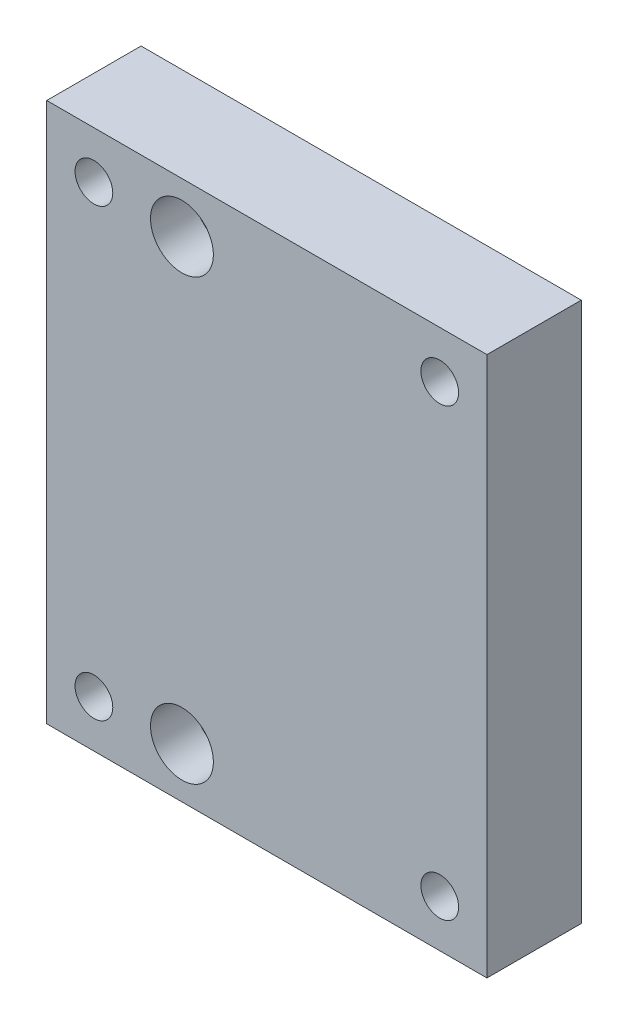
ISO-10303-21;
HEADER;
FILE_DESCRIPTION(('STEP AP214'),'2;1');
FILE_NAME('part.step','',(''),(''),'','','');
FILE_SCHEMA(('AUTOMOTIVE_DESIGN { 1 0 10303 214 1 1 1 1 }'));
ENDSEC;
DATA;
#1=APPLICATION_CONTEXT('core data for automotive mechanical design processes');
#2=APPLICATION_PROTOCOL_DEFINITION('international standard','automotive_design',2000,#1);
#3=PRODUCT_CONTEXT('',#1,'mechanical');
#4=PRODUCT('Part','Part','',(#3));
#5=PRODUCT_RELATED_PRODUCT_CATEGORY('part','',(#4));
#6=PRODUCT_DEFINITION_FORMATION('','',#4);
#7=PRODUCT_DEFINITION_CONTEXT('part definition',#1,'design');
#8=PRODUCT_DEFINITION('design','',#6,#7);
#9=PRODUCT_DEFINITION_SHAPE('','',#8);
#10=(LENGTH_UNIT() NAMED_UNIT(*) SI_UNIT(.MILLI.,.METRE.));
#11=(NAMED_UNIT(*) PLANE_ANGLE_UNIT() SI_UNIT($,.RADIAN.));
#12=(NAMED_UNIT(*) SI_UNIT($,.STERADIAN.) SOLID_ANGLE_UNIT());
#13=UNCERTAINTY_MEASURE_WITH_UNIT(LENGTH_MEASURE(1.E-05),#10,'distance_accuracy_value','');
#14=(GEOMETRIC_REPRESENTATION_CONTEXT(3) GLOBAL_UNCERTAINTY_ASSIGNED_CONTEXT((#13)) GLOBAL_UNIT_ASSIGNED_CONTEXT((#10,
#11,#12)) REPRESENTATION_CONTEXT('',''));
#15=CARTESIAN_POINT('',(0.,0.,0.));
#16=DIRECTION('',(0.,0.,1.));
#17=DIRECTION('',(1.,0.,0.));
#18=AXIS2_PLACEMENT_3D('',#15,#16,#17);
#19=CARTESIAN_POINT('',(-27.5,-35.425,0.));
#20=DIRECTION('',(0.,0.,1.));
#21=DIRECTION('',(1.,0.,0.));
#22=AXIS2_PLACEMENT_3D('',#19,#20,#21);
#23=CYLINDRICAL_SURFACE('',#22,3.);
#24=CARTESIAN_POINT('',(-27.5,-35.425,0.));
#25=DIRECTION('',(0.,0.,1.));
#26=DIRECTION('',(1.,0.,0.));
#27=AXIS2_PLACEMENT_3D('',#24,#25,#26);
#28=CIRCLE('',#27,3.);
#29=CARTESIAN_POINT('',(-24.5,-35.425,0.));
#30=VERTEX_POINT('',#29);
#31=EDGE_CURVE('E41',#30,#30,#28,.T.);
#32=ORIENTED_EDGE('',*,*,#31,.F.);
#33=EDGE_LOOP('',(#32));
#34=FACE_BOUND('',#33,.T.);
#35=CARTESIAN_POINT('',(-27.5,-35.425,15.));
#36=DIRECTION('',(0.,0.,1.));
#37=DIRECTION('',(1.,0.,0.));
#38=AXIS2_PLACEMENT_3D('',#35,#36,#37);
#39=CIRCLE('',#38,3.);
#40=CARTESIAN_POINT('',(-24.5,-35.425,15.));
#41=VERTEX_POINT('',#40);
#42=EDGE_CURVE('E11',#41,#41,#39,.T.);
#43=ORIENTED_EDGE('',*,*,#42,.T.);
#44=EDGE_LOOP('',(#43));
#45=FACE_BOUND('',#44,.T.);
#46=ADVANCED_FACE('F33',(#34,#45),#23,.F.);
#47=CARTESIAN_POINT('',(27.5,-35.425,0.));
#48=DIRECTION('',(0.,0.,1.));
#49=DIRECTION('',(1.,0.,0.));
#50=AXIS2_PLACEMENT_3D('',#47,#48,#49);
#51=CYLINDRICAL_SURFACE('',#50,3.);
#52=CARTESIAN_POINT('',(27.5,-35.425,0.));
#53=DIRECTION('',(0.,0.,1.));
#54=DIRECTION('',(1.,0.,0.));
#55=AXIS2_PLACEMENT_3D('',#52,#53,#54);
#56=CIRCLE('',#55,3.);
#57=CARTESIAN_POINT('',(30.5,-35.425,0.));
#58=VERTEX_POINT('',#57);
#59=EDGE_CURVE('E111',#58,#58,#56,.T.);
#60=ORIENTED_EDGE('',*,*,#59,.F.);
#61=EDGE_LOOP('',(#60));
#62=FACE_BOUND('',#61,.T.);
#63=CARTESIAN_POINT('',(27.5,-35.425,15.));
#64=DIRECTION('',(0.,0.,1.));
#65=DIRECTION('',(1.,0.,0.));
#66=AXIS2_PLACEMENT_3D('',#63,#64,#65);
#67=CIRCLE('',#66,3.);
#68=CARTESIAN_POINT('',(30.5,-35.425,15.));
#69=VERTEX_POINT('',#68);
#70=EDGE_CURVE('E122',#69,#69,#67,.T.);
#71=ORIENTED_EDGE('',*,*,#70,.T.);
#72=EDGE_LOOP('',(#71));
#73=FACE_BOUND('',#72,.T.);
#74=ADVANCED_FACE('F131',(#62,#73),#51,.F.);
#75=CARTESIAN_POINT('',(-13.5,-34.925,0.));
#76=DIRECTION('',(0.,0.,1.));
#77=DIRECTION('',(1.,0.,0.));
#78=AXIS2_PLACEMENT_3D('',#75,#76,#77);
#79=CYLINDRICAL_SURFACE('',#78,3.);
#80=CARTESIAN_POINT('',(-13.5,-34.925,0.));
#81=DIRECTION('',(0.,0.,1.));
#82=DIRECTION('',(1.,0.,0.));
#83=AXIS2_PLACEMENT_3D('',#80,#81,#82);
#84=CIRCLE('',#83,3.);
#85=CARTESIAN_POINT('',(-10.5,-34.925,0.));
#86=VERTEX_POINT('',#85);
#87=EDGE_CURVE('E119',#86,#86,#84,.T.);
#88=ORIENTED_EDGE('',*,*,#87,.F.);
#89=EDGE_LOOP('',(#88));
#90=FACE_BOUND('',#89,.T.);
#91=CARTESIAN_POINT('',(-13.5,-34.925,8.));
#92=DIRECTION('',(0.,0.,1.));
#93=DIRECTION('',(1.,0.,0.));
#94=AXIS2_PLACEMENT_3D('',#91,#92,#93);
#95=CIRCLE('',#94,3.);
#96=CARTESIAN_POINT('',(-10.5,-34.925,8.));
#97=VERTEX_POINT('',#96);
#98=EDGE_CURVE('E115',#97,#97,#95,.F.);
#99=ORIENTED_EDGE('',*,*,#98,.F.);
#100=EDGE_LOOP('',(#99));
#101=FACE_BOUND('',#100,.T.);
#102=ADVANCED_FACE('F149',(#90,#101),#79,.F.);
#103=CARTESIAN_POINT('',(-13.5,34.925,0.));
#104=DIRECTION('',(0.,0.,1.));
#105=DIRECTION('',(1.,0.,0.));
#106=AXIS2_PLACEMENT_3D('',#103,#104,#105);
#107=CYLINDRICAL_SURFACE('',#106,3.);
#108=CARTESIAN_POINT('',(-13.5,34.925,0.));
#109=DIRECTION('',(0.,0.,1.));
#110=DIRECTION('',(1.,0.,0.));
#111=AXIS2_PLACEMENT_3D('',#108,#109,#110);
#112=CIRCLE('',#111,3.);
#113=CARTESIAN_POINT('',(-10.5,34.925,0.));
#114=VERTEX_POINT('',#113);
#115=EDGE_CURVE('E104',#114,#114,#112,.T.);
#116=ORIENTED_EDGE('',*,*,#115,.F.);
#117=EDGE_LOOP('',(#116));
#118=FACE_BOUND('',#117,.T.);
#119=CARTESIAN_POINT('',(-13.5,34.925,8.));
#120=DIRECTION('',(0.,0.,1.));
#121=DIRECTION('',(1.,0.,0.));
#122=AXIS2_PLACEMENT_3D('',#119,#120,#121);
#123=CIRCLE('',#122,3.);
#124=CARTESIAN_POINT('',(-10.5,34.925,8.));
#125=VERTEX_POINT('',#124);
#126=EDGE_CURVE('E112',#125,#125,#123,.F.);
#127=ORIENTED_EDGE('',*,*,#126,.F.);
#128=EDGE_LOOP('',(#127));
#129=FACE_BOUND('',#128,.T.);
#130=ADVANCED_FACE('F158',(#118,#129),#107,.F.);
#131=CARTESIAN_POINT('',(-35.,-42.925,15.));
#132=DIRECTION('',(1.,0.,0.));
#133=DIRECTION('',(0.,0.,-1.));
#134=AXIS2_PLACEMENT_3D('',#131,#132,#133);
#135=PLANE('',#134);
#136=DIRECTION('',(0.,-1.,0.));
#137=VECTOR('',#136,1.);
#138=CARTESIAN_POINT('',(-35.,-42.925,0.));
#139=LINE('',#138,#137);
#140=CARTESIAN_POINT('',(-35.,42.925,0.));
#141=VERTEX_POINT('',#140);
#142=CARTESIAN_POINT('',(-35.,-42.925,0.));
#143=VERTEX_POINT('',#142);
#144=EDGE_CURVE('E101',#141,#143,#139,.T.);
#145=ORIENTED_EDGE('',*,*,#144,.T.);
#146=DIRECTION('',(0.,0.,-1.));
#147=VECTOR('',#146,1.);
#148=CARTESIAN_POINT('',(-35.,-42.925,15.));
#149=LINE('',#148,#147);
#150=CARTESIAN_POINT('',(-35.,-42.925,15.));
#151=VERTEX_POINT('',#150);
#152=EDGE_CURVE('E92',#151,#143,#149,.T.);
#153=ORIENTED_EDGE('',*,*,#152,.F.);
#154=DIRECTION('',(0.,-1.,0.));
#155=VECTOR('',#154,1.);
#156=CARTESIAN_POINT('',(-35.,-42.925,15.));
#157=LINE('',#156,#155);
#158=CARTESIAN_POINT('',(-35.,42.925,15.));
#159=VERTEX_POINT('',#158);
#160=EDGE_CURVE('E86',#159,#151,#157,.T.);
#161=ORIENTED_EDGE('',*,*,#160,.F.);
#162=DIRECTION('',(0.,0.,-1.));
#163=VECTOR('',#162,1.);
#164=CARTESIAN_POINT('',(-35.,42.925,15.));
#165=LINE('',#164,#163);
#166=EDGE_CURVE('E97',#159,#141,#165,.T.);
#167=ORIENTED_EDGE('',*,*,#166,.T.);
#168=EDGE_LOOP('',(#145,#153,#161,#167));
#169=FACE_BOUND('',#168,.T.);
#170=ADVANCED_FACE('F156',(#169),#135,.F.);
#171=CARTESIAN_POINT('',(35.,-42.925,15.));
#172=DIRECTION('',(0.,1.,0.));
#173=DIRECTION('',(-1.,0.,0.));
#174=AXIS2_PLACEMENT_3D('',#171,#172,#173);
#175=PLANE('',#174);
#176=DIRECTION('',(1.,0.,0.));
#177=VECTOR('',#176,1.);
#178=CARTESIAN_POINT('',(35.,-42.925,0.));
#179=LINE('',#178,#177);
#180=CARTESIAN_POINT('',(35.,-42.925,0.));
#181=VERTEX_POINT('',#180);
#182=EDGE_CURVE('E91',#143,#181,#179,.T.);
#183=ORIENTED_EDGE('',*,*,#182,.T.);
#184=DIRECTION('',(0.,0.,-1.));
#185=VECTOR('',#184,1.);
#186=CARTESIAN_POINT('',(35.,-42.925,15.));
#187=LINE('',#186,#185);
#188=CARTESIAN_POINT('',(35.,-42.925,15.));
#189=VERTEX_POINT('',#188);
#190=EDGE_CURVE('E89',#189,#181,#187,.T.);
#191=ORIENTED_EDGE('',*,*,#190,.F.);
#192=DIRECTION('',(1.,0.,0.));
#193=VECTOR('',#192,1.);
#194=CARTESIAN_POINT('',(35.,-42.925,15.));
#195=LINE('',#194,#193);
#196=EDGE_CURVE('E80',#151,#189,#195,.T.);
#197=ORIENTED_EDGE('',*,*,#196,.F.);
#198=ORIENTED_EDGE('',*,*,#152,.T.);
#199=EDGE_LOOP('',(#183,#191,#197,#198));
#200=FACE_BOUND('',#199,.T.);
#201=ADVANCED_FACE('F90',(#200),#175,.F.);
#202=CARTESIAN_POINT('',(35.,-42.925,15.));
#203=DIRECTION('',(-1.,0.,0.));
#204=DIRECTION('',(0.,0.,1.));
#205=AXIS2_PLACEMENT_3D('',#202,#203,#204);
#206=PLANE('',#205);
#207=DIRECTION('',(0.,1.,0.));
#208=VECTOR('',#207,1.);
#209=CARTESIAN_POINT('',(35.,-42.925,0.));
#210=LINE('',#209,#208);
#211=CARTESIAN_POINT('',(35.,42.925,0.));
#212=VERTEX_POINT('',#211);
#213=EDGE_CURVE('E66',#181,#212,#210,.T.);
#214=ORIENTED_EDGE('',*,*,#213,.T.);
#215=DIRECTION('',(0.,0.,-1.));
#216=VECTOR('',#215,1.);
#217=CARTESIAN_POINT('',(35.,42.925,15.));
#218=LINE('',#217,#216);
#219=CARTESIAN_POINT('',(35.,42.925,15.));
#220=VERTEX_POINT('',#219);
#221=EDGE_CURVE('E93',#220,#212,#218,.T.);
#222=ORIENTED_EDGE('',*,*,#221,.F.);
#223=DIRECTION('',(0.,1.,0.));
#224=VECTOR('',#223,1.);
#225=CARTESIAN_POINT('',(35.,-42.925,15.));
#226=LINE('',#225,#224);
#227=EDGE_CURVE('E84',#189,#220,#226,.T.);
#228=ORIENTED_EDGE('',*,*,#227,.F.);
#229=ORIENTED_EDGE('',*,*,#190,.T.);
#230=EDGE_LOOP('',(#214,#222,#228,#229));
#231=FACE_BOUND('',#230,.T.);
#232=ADVANCED_FACE('F95',(#231),#206,.F.);
#233=CARTESIAN_POINT('',(35.,42.925,15.));
#234=DIRECTION('',(0.,-1.,0.));
#235=DIRECTION('',(0.,0.,-1.));
#236=AXIS2_PLACEMENT_3D('',#233,#234,#235);
#237=PLANE('',#236);
#238=DIRECTION('',(-1.,0.,0.));
#239=VECTOR('',#238,1.);
#240=CARTESIAN_POINT('',(35.,42.925,0.));
#241=LINE('',#240,#239);
#242=EDGE_CURVE('E72',#212,#141,#241,.T.);
#243=ORIENTED_EDGE('',*,*,#242,.T.);
#244=ORIENTED_EDGE('',*,*,#166,.F.);
#245=DIRECTION('',(-1.,0.,0.));
#246=VECTOR('',#245,1.);
#247=CARTESIAN_POINT('',(35.,42.925,15.));
#248=LINE('',#247,#246);
#249=EDGE_CURVE('E49',#220,#159,#248,.T.);
#250=ORIENTED_EDGE('',*,*,#249,.F.);
#251=ORIENTED_EDGE('',*,*,#221,.T.);
#252=EDGE_LOOP('',(#243,#244,#250,#251));
#253=FACE_BOUND('',#252,.T.);
#254=ADVANCED_FACE('F135',(#253),#237,.F.);
#255=CARTESIAN_POINT('',(0.,0.,15.));
#256=DIRECTION('',(0.,0.,1.));
#257=DIRECTION('',(1.,0.,0.));
#258=AXIS2_PLACEMENT_3D('',#255,#256,#257);
#259=PLANE('',#258);
#260=CARTESIAN_POINT('',(-27.5,35.425,15.));
#261=DIRECTION('',(0.,0.,1.));
#262=DIRECTION('',(1.,0.,0.));
#263=AXIS2_PLACEMENT_3D('',#260,#261,#262);
#264=CIRCLE('',#263,3.);
#265=CARTESIAN_POINT('',(-24.5,35.425,15.));
#266=VERTEX_POINT('',#265);
#267=EDGE_CURVE('E212',#266,#266,#264,.T.);
#268=ORIENTED_EDGE('',*,*,#267,.F.);
#269=EDGE_LOOP('',(#268));
#270=FACE_BOUND('',#269,.T.);
#271=CARTESIAN_POINT('',(27.5,35.425,15.));
#272=DIRECTION('',(0.,0.,1.));
#273=DIRECTION('',(1.,0.,0.));
#274=AXIS2_PLACEMENT_3D('',#271,#272,#273);
#275=CIRCLE('',#274,3.);
#276=CARTESIAN_POINT('',(30.5,35.425,15.));
#277=VERTEX_POINT('',#276);
#278=EDGE_CURVE('E213',#277,#277,#275,.T.);
#279=ORIENTED_EDGE('',*,*,#278,.F.);
#280=EDGE_LOOP('',(#279));
#281=FACE_BOUND('',#280,.T.);
#282=CARTESIAN_POINT('',(-13.5,34.925,15.));
#283=DIRECTION('',(0.,0.,1.));
#284=DIRECTION('',(1.,0.,0.));
#285=AXIS2_PLACEMENT_3D('',#282,#283,#284);
#286=CIRCLE('',#285,5.);
#287=CARTESIAN_POINT('',(-8.50000000000002,34.925,15.));
#288=VERTEX_POINT('',#287);
#289=EDGE_CURVE('E225',#288,#288,#286,.T.);
#290=ORIENTED_EDGE('',*,*,#289,.F.);
#291=EDGE_LOOP('',(#290));
#292=FACE_BOUND('',#291,.T.);
#293=CARTESIAN_POINT('',(-13.5,-34.925,15.));
#294=DIRECTION('',(0.,0.,1.));
#295=DIRECTION('',(1.,0.,0.));
#296=AXIS2_PLACEMENT_3D('',#293,#294,#295);
#297=CIRCLE('',#296,5.);
#298=CARTESIAN_POINT('',(-8.50000000000002,-34.925,15.));
#299=VERTEX_POINT('',#298);
#300=EDGE_CURVE('E221',#299,#299,#297,.T.);
#301=ORIENTED_EDGE('',*,*,#300,.F.);
#302=EDGE_LOOP('',(#301));
#303=FACE_BOUND('',#302,.T.);
#304=ORIENTED_EDGE('',*,*,#160,.T.);
#305=ORIENTED_EDGE('',*,*,#196,.T.);
#306=ORIENTED_EDGE('',*,*,#227,.T.);
#307=ORIENTED_EDGE('',*,*,#249,.T.);
#308=EDGE_LOOP('',(#304,#305,#306,#307));
#309=FACE_BOUND('',#308,.T.);
#310=ORIENTED_EDGE('',*,*,#70,.F.);
#311=EDGE_LOOP('',(#310));
#312=FACE_BOUND('',#311,.T.);
#313=ORIENTED_EDGE('',*,*,#42,.F.);
#314=EDGE_LOOP('',(#313));
#315=FACE_BOUND('',#314,.T.);
#316=ADVANCED_FACE('F81',(#270,#281,#292,#303,#309,#312,#315),#259,.T.);
#317=CARTESIAN_POINT('',(0.,0.,0.));
#318=DIRECTION('',(0.,0.,1.));
#319=DIRECTION('',(1.,0.,0.));
#320=AXIS2_PLACEMENT_3D('',#317,#318,#319);
#321=PLANE('',#320);
#322=CARTESIAN_POINT('',(-27.5,35.425,0.));
#323=DIRECTION('',(0.,0.,1.));
#324=DIRECTION('',(1.,0.,0.));
#325=AXIS2_PLACEMENT_3D('',#322,#323,#324);
#326=CIRCLE('',#325,3.);
#327=CARTESIAN_POINT('',(-24.5,35.425,0.));
#328=VERTEX_POINT('',#327);
#329=EDGE_CURVE('E210',#328,#328,#326,.T.);
#330=ORIENTED_EDGE('',*,*,#329,.T.);
#331=EDGE_LOOP('',(#330));
#332=FACE_BOUND('',#331,.T.);
#333=CARTESIAN_POINT('',(27.5,35.425,0.));
#334=DIRECTION('',(0.,0.,1.));
#335=DIRECTION('',(1.,0.,0.));
#336=AXIS2_PLACEMENT_3D('',#333,#334,#335);
#337=CIRCLE('',#336,3.);
#338=CARTESIAN_POINT('',(30.5,35.425,0.));
#339=VERTEX_POINT('',#338);
#340=EDGE_CURVE('E216',#339,#339,#337,.T.);
#341=ORIENTED_EDGE('',*,*,#340,.T.);
#342=EDGE_LOOP('',(#341));
#343=FACE_BOUND('',#342,.T.);
#344=ORIENTED_EDGE('',*,*,#115,.T.);
#345=EDGE_LOOP('',(#344));
#346=FACE_BOUND('',#345,.T.);
#347=ORIENTED_EDGE('',*,*,#87,.T.);
#348=EDGE_LOOP('',(#347));
#349=FACE_BOUND('',#348,.T.);
#350=ORIENTED_EDGE('',*,*,#144,.F.);
#351=ORIENTED_EDGE('',*,*,#242,.F.);
#352=ORIENTED_EDGE('',*,*,#213,.F.);
#353=ORIENTED_EDGE('',*,*,#182,.F.);
#354=EDGE_LOOP('',(#350,#351,#352,#353));
#355=FACE_BOUND('',#354,.T.);
#356=ORIENTED_EDGE('',*,*,#59,.T.);
#357=EDGE_LOOP('',(#356));
#358=FACE_BOUND('',#357,.T.);
#359=ORIENTED_EDGE('',*,*,#31,.T.);
#360=EDGE_LOOP('',(#359));
#361=FACE_BOUND('',#360,.T.);
#362=ADVANCED_FACE('F127',(#332,#343,#346,#349,#355,#358,#361),#321,.F.);
#363=CARTESIAN_POINT('',(-13.5,34.925,8.));
#364=DIRECTION('',(0.,0.,1.));
#365=DIRECTION('',(1.,0.,0.));
#366=AXIS2_PLACEMENT_3D('',#363,#364,#365);
#367=PLANE('',#366);
#368=CARTESIAN_POINT('',(-13.5,34.925,8.));
#369=DIRECTION('',(0.,0.,1.));
#370=DIRECTION('',(1.,0.,0.));
#371=AXIS2_PLACEMENT_3D('',#368,#369,#370);
#372=CIRCLE('',#371,5.);
#373=CARTESIAN_POINT('',(-8.50000000000002,34.925,8.));
#374=VERTEX_POINT('',#373);
#375=EDGE_CURVE('E116',#374,#374,#372,.T.);
#376=ORIENTED_EDGE('',*,*,#375,.T.);
#377=EDGE_LOOP('',(#376));
#378=FACE_BOUND('',#377,.T.);
#379=ORIENTED_EDGE('',*,*,#126,.T.);
#380=EDGE_LOOP('',(#379));
#381=FACE_BOUND('',#380,.T.);
#382=ADVANCED_FACE('F142',(#378,#381),#367,.T.);
#383=CARTESIAN_POINT('',(-13.5,34.925,8.));
#384=DIRECTION('',(0.,0.,1.));
#385=DIRECTION('',(1.,0.,0.));
#386=AXIS2_PLACEMENT_3D('',#383,#384,#385);
#387=CYLINDRICAL_SURFACE('',#386,5.);
#388=ORIENTED_EDGE('',*,*,#375,.F.);
#389=EDGE_LOOP('',(#388));
#390=FACE_BOUND('',#389,.T.);
#391=ORIENTED_EDGE('',*,*,#289,.T.);
#392=EDGE_LOOP('',(#391));
#393=FACE_BOUND('',#392,.T.);
#394=ADVANCED_FACE('F182',(#390,#393),#387,.F.);
#395=CARTESIAN_POINT('',(-13.5,-34.925,8.));
#396=DIRECTION('',(0.,0.,1.));
#397=DIRECTION('',(1.,0.,0.));
#398=AXIS2_PLACEMENT_3D('',#395,#396,#397);
#399=PLANE('',#398);
#400=CARTESIAN_POINT('',(-13.5,-34.925,8.));
#401=DIRECTION('',(0.,0.,1.));
#402=DIRECTION('',(1.,0.,0.));
#403=AXIS2_PLACEMENT_3D('',#400,#401,#402);
#404=CIRCLE('',#403,5.);
#405=CARTESIAN_POINT('',(-8.50000000000002,-34.925,8.));
#406=VERTEX_POINT('',#405);
#407=EDGE_CURVE('E228',#406,#406,#404,.T.);
#408=ORIENTED_EDGE('',*,*,#407,.T.);
#409=EDGE_LOOP('',(#408));
#410=FACE_BOUND('',#409,.T.);
#411=ORIENTED_EDGE('',*,*,#98,.T.);
#412=EDGE_LOOP('',(#411));
#413=FACE_BOUND('',#412,.T.);
#414=ADVANCED_FACE('F179',(#410,#413),#399,.T.);
#415=CARTESIAN_POINT('',(-13.5,-34.925,8.));
#416=DIRECTION('',(0.,0.,1.));
#417=DIRECTION('',(1.,0.,0.));
#418=AXIS2_PLACEMENT_3D('',#415,#416,#417);
#419=CYLINDRICAL_SURFACE('',#418,5.);
#420=ORIENTED_EDGE('',*,*,#407,.F.);
#421=EDGE_LOOP('',(#420));
#422=FACE_BOUND('',#421,.T.);
#423=ORIENTED_EDGE('',*,*,#300,.T.);
#424=EDGE_LOOP('',(#423));
#425=FACE_BOUND('',#424,.T.);
#426=ADVANCED_FACE('F181',(#422,#425),#419,.F.);
#427=CARTESIAN_POINT('',(27.5,35.425,0.));
#428=DIRECTION('',(0.,0.,1.));
#429=DIRECTION('',(1.,0.,0.));
#430=AXIS2_PLACEMENT_3D('',#427,#428,#429);
#431=CYLINDRICAL_SURFACE('',#430,3.);
#432=ORIENTED_EDGE('',*,*,#340,.F.);
#433=EDGE_LOOP('',(#432));
#434=FACE_BOUND('',#433,.T.);
#435=ORIENTED_EDGE('',*,*,#278,.T.);
#436=EDGE_LOOP('',(#435));
#437=FACE_BOUND('',#436,.T.);
#438=ADVANCED_FACE('F189',(#434,#437),#431,.F.);
#439=CARTESIAN_POINT('',(-27.5,35.425,0.));
#440=DIRECTION('',(0.,0.,1.));
#441=DIRECTION('',(1.,0.,0.));
#442=AXIS2_PLACEMENT_3D('',#439,#440,#441);
#443=CYLINDRICAL_SURFACE('',#442,3.);
#444=ORIENTED_EDGE('',*,*,#329,.F.);
#445=EDGE_LOOP('',(#444));
#446=FACE_BOUND('',#445,.T.);
#447=ORIENTED_EDGE('',*,*,#267,.T.);
#448=EDGE_LOOP('',(#447));
#449=FACE_BOUND('',#448,.T.);
#450=ADVANCED_FACE('F201',(#446,#449),#443,.F.);
#451=CLOSED_SHELL('',(#46,#74,#102,#130,#170,#201,#232,#254,#316,#362,#382,#394,#414,#426,#438,#450));
#452=MANIFOLD_SOLID_BREP('B2',#451);
#453=ADVANCED_BREP_SHAPE_REPRESENTATION('',(#18,#452),#14);
#454=SHAPE_DEFINITION_REPRESENTATION(#9,#453);
ENDSEC;
END-ISO-10303-21;
